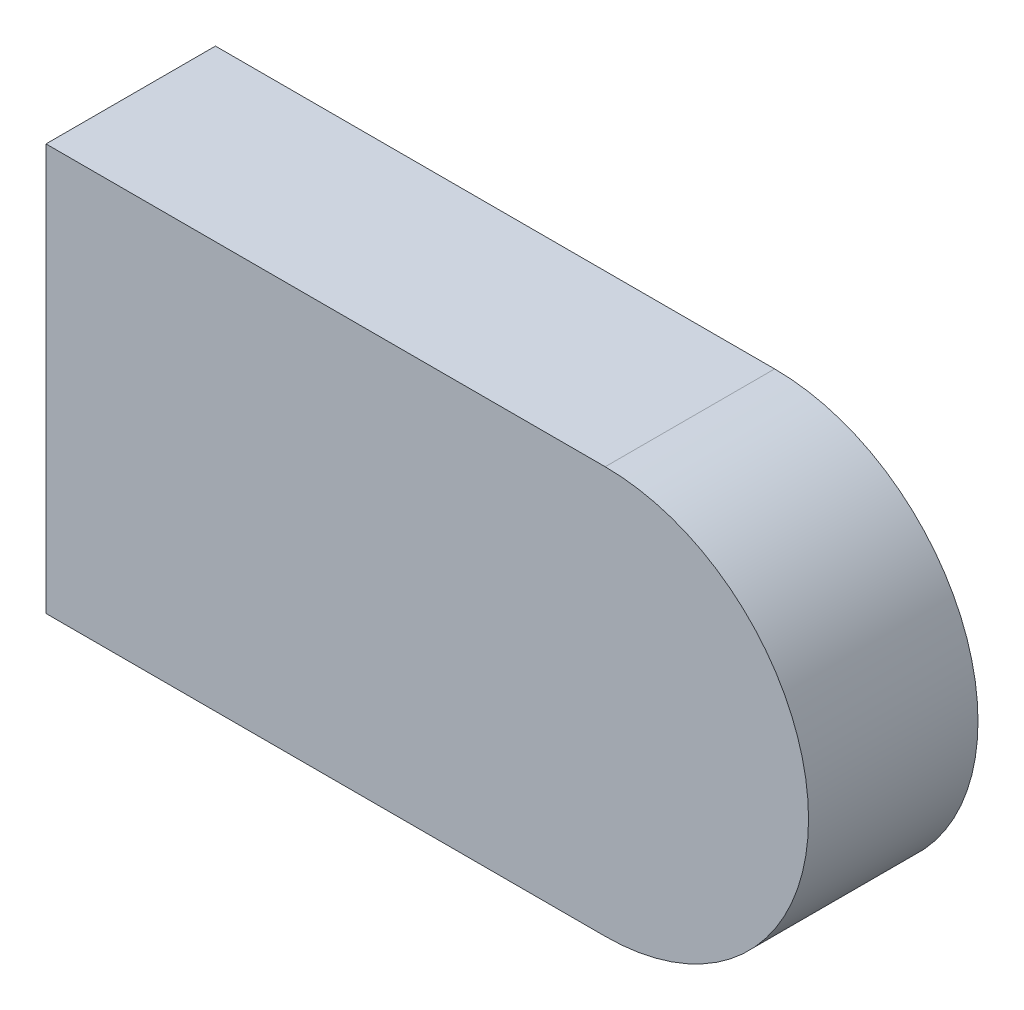
ISO-10303-21;
HEADER;
FILE_DESCRIPTION(('STEP AP214'),'2;1');
FILE_NAME('part.step','',(''),(''),'','','');
FILE_SCHEMA(('AUTOMOTIVE_DESIGN { 1 0 10303 214 1 1 1 1 }'));
ENDSEC;
DATA;
#1=APPLICATION_CONTEXT('core data for automotive mechanical design processes');
#2=APPLICATION_PROTOCOL_DEFINITION('international standard','automotive_design',2000,#1);
#3=PRODUCT_CONTEXT('',#1,'mechanical');
#4=PRODUCT('Part','Part','',(#3));
#5=PRODUCT_RELATED_PRODUCT_CATEGORY('part','',(#4));
#6=PRODUCT_DEFINITION_FORMATION('','',#4);
#7=PRODUCT_DEFINITION_CONTEXT('part definition',#1,'design');
#8=PRODUCT_DEFINITION('design','',#6,#7);
#9=PRODUCT_DEFINITION_SHAPE('','',#8);
#10=(LENGTH_UNIT() NAMED_UNIT(*) SI_UNIT(.MILLI.,.METRE.));
#11=(NAMED_UNIT(*) PLANE_ANGLE_UNIT() SI_UNIT($,.RADIAN.));
#12=(NAMED_UNIT(*) SI_UNIT($,.STERADIAN.) SOLID_ANGLE_UNIT());
#13=UNCERTAINTY_MEASURE_WITH_UNIT(LENGTH_MEASURE(1.E-05),#10,'distance_accuracy_value','');
#14=(GEOMETRIC_REPRESENTATION_CONTEXT(3) GLOBAL_UNCERTAINTY_ASSIGNED_CONTEXT((#13)) GLOBAL_UNIT_ASSIGNED_CONTEXT((#10,
#11,#12)) REPRESENTATION_CONTEXT('',''));
#15=CARTESIAN_POINT('',(0.,0.,0.));
#16=DIRECTION('',(0.,0.,1.));
#17=DIRECTION('',(1.,0.,0.));
#18=AXIS2_PLACEMENT_3D('',#15,#16,#17);
#19=CARTESIAN_POINT('',(-4.05,-1.87,0.));
#20=DIRECTION('',(0.,1.,0.));
#21=DIRECTION('',(1.,0.,0.));
#22=AXIS2_PLACEMENT_3D('',#19,#20,#21);
#23=PLANE('',#22);
#24=DIRECTION('',(1.,0.,0.));
#25=VECTOR('',#24,1.);
#26=CARTESIAN_POINT('',(-4.05,-1.87,0.));
#27=LINE('',#26,#25);
#28=CARTESIAN_POINT('',(-4.05,-1.87,0.));
#29=VERTEX_POINT('',#28);
#30=CARTESIAN_POINT('',(-3.72,-1.87,0.));
#31=VERTEX_POINT('',#30);
#32=EDGE_CURVE('E11',#29,#31,#27,.T.);
#33=ORIENTED_EDGE('',*,*,#32,.T.);
#34=DIRECTION('',(0.,0.,1.));
#35=VECTOR('',#34,1.);
#36=CARTESIAN_POINT('',(-3.72,-1.87,0.));
#37=LINE('',#36,#35);
#38=CARTESIAN_POINT('',(-3.72,-1.87,0.1));
#39=VERTEX_POINT('',#38);
#40=EDGE_CURVE('E24',#31,#39,#37,.T.);
#41=ORIENTED_EDGE('',*,*,#40,.T.);
#42=DIRECTION('',(1.,0.,0.));
#43=VECTOR('',#42,1.);
#44=CARTESIAN_POINT('',(-4.05,-1.87,0.1));
#45=LINE('',#44,#43);
#46=CARTESIAN_POINT('',(-4.05,-1.87,0.1));
#47=VERTEX_POINT('',#46);
#48=EDGE_CURVE('E88',#47,#39,#45,.T.);
#49=ORIENTED_EDGE('',*,*,#48,.F.);
#50=DIRECTION('',(0.,0.,1.));
#51=VECTOR('',#50,1.);
#52=CARTESIAN_POINT('',(-4.05,-1.87,0.));
#53=LINE('',#52,#51);
#54=EDGE_CURVE('E36',#29,#47,#53,.T.);
#55=ORIENTED_EDGE('',*,*,#54,.F.);
#56=EDGE_LOOP('',(#33,#41,#49,#55));
#57=FACE_BOUND('',#56,.T.);
#58=ADVANCED_FACE('F17',(#57),#23,.F.);
#59=CARTESIAN_POINT('',(-3.72,-1.75,0.));
#60=DIRECTION('',(0.,0.,-1.));
#61=DIRECTION('',(1.,0.,0.));
#62=AXIS2_PLACEMENT_3D('',#59,#60,#61);
#63=CYLINDRICAL_SURFACE('',#62,0.12);
#64=CARTESIAN_POINT('',(-3.72,-1.75,0.));
#65=DIRECTION('',(0.,0.,1.));
#66=DIRECTION('',(1.,0.,0.));
#67=AXIS2_PLACEMENT_3D('',#64,#65,#66);
#68=CIRCLE('',#67,0.12);
#69=CARTESIAN_POINT('',(-3.72,-1.63,0.));
#70=VERTEX_POINT('',#69);
#71=EDGE_CURVE('E85',#31,#70,#68,.T.);
#72=ORIENTED_EDGE('',*,*,#71,.T.);
#73=DIRECTION('',(0.,0.,1.));
#74=VECTOR('',#73,1.);
#75=CARTESIAN_POINT('',(-3.72,-1.63,0.));
#76=LINE('',#75,#74);
#77=CARTESIAN_POINT('',(-3.72,-1.63,0.1));
#78=VERTEX_POINT('',#77);
#79=EDGE_CURVE('E73',#70,#78,#76,.T.);
#80=ORIENTED_EDGE('',*,*,#79,.T.);
#81=CARTESIAN_POINT('',(-3.72,-1.75,0.1));
#82=DIRECTION('',(0.,0.,1.));
#83=DIRECTION('',(1.,0.,0.));
#84=AXIS2_PLACEMENT_3D('',#81,#82,#83);
#85=CIRCLE('',#84,0.12);
#86=EDGE_CURVE('E66',#39,#78,#85,.T.);
#87=ORIENTED_EDGE('',*,*,#86,.F.);
#88=ORIENTED_EDGE('',*,*,#40,.F.);
#89=EDGE_LOOP('',(#72,#80,#87,#88));
#90=FACE_BOUND('',#89,.T.);
#91=ADVANCED_FACE('F89',(#90),#63,.T.);
#92=CARTESIAN_POINT('',(-4.05,-1.63,0.));
#93=DIRECTION('',(0.,1.,0.));
#94=DIRECTION('',(1.,0.,0.));
#95=AXIS2_PLACEMENT_3D('',#92,#93,#94);
#96=PLANE('',#95);
#97=DIRECTION('',(0.,0.,1.));
#98=VECTOR('',#97,1.);
#99=CARTESIAN_POINT('',(-4.05,-1.63,0.));
#100=LINE('',#99,#98);
#101=CARTESIAN_POINT('',(-4.05,-1.63,0.));
#102=VERTEX_POINT('',#101);
#103=CARTESIAN_POINT('',(-4.05,-1.63,0.1));
#104=VERTEX_POINT('',#103);
#105=EDGE_CURVE('E56',#102,#104,#100,.T.);
#106=ORIENTED_EDGE('',*,*,#105,.T.);
#107=DIRECTION('',(1.,0.,0.));
#108=VECTOR('',#107,1.);
#109=CARTESIAN_POINT('',(-4.05,-1.63,0.1));
#110=LINE('',#109,#108);
#111=EDGE_CURVE('E67',#104,#78,#110,.T.);
#112=ORIENTED_EDGE('',*,*,#111,.T.);
#113=ORIENTED_EDGE('',*,*,#79,.F.);
#114=DIRECTION('',(1.,0.,0.));
#115=VECTOR('',#114,1.);
#116=CARTESIAN_POINT('',(-4.05,-1.63,0.));
#117=LINE('',#116,#115);
#118=EDGE_CURVE('E71',#102,#70,#117,.T.);
#119=ORIENTED_EDGE('',*,*,#118,.F.);
#120=EDGE_LOOP('',(#106,#112,#113,#119));
#121=FACE_BOUND('',#120,.T.);
#122=ADVANCED_FACE('F72',(#121),#96,.T.);
#123=CARTESIAN_POINT('',(-4.05,-1.87,0.));
#124=DIRECTION('',(-1.,0.,0.));
#125=DIRECTION('',(0.,1.,0.));
#126=AXIS2_PLACEMENT_3D('',#123,#124,#125);
#127=PLANE('',#126);
#128=ORIENTED_EDGE('',*,*,#54,.T.);
#129=DIRECTION('',(0.,1.,0.));
#130=VECTOR('',#129,1.);
#131=CARTESIAN_POINT('',(-4.05,-1.87,0.1));
#132=LINE('',#131,#130);
#133=EDGE_CURVE('E62',#47,#104,#132,.T.);
#134=ORIENTED_EDGE('',*,*,#133,.T.);
#135=ORIENTED_EDGE('',*,*,#105,.F.);
#136=DIRECTION('',(0.,1.,0.));
#137=VECTOR('',#136,1.);
#138=CARTESIAN_POINT('',(-4.05,-1.87,0.));
#139=LINE('',#138,#137);
#140=EDGE_CURVE('E60',#29,#102,#139,.T.);
#141=ORIENTED_EDGE('',*,*,#140,.F.);
#142=EDGE_LOOP('',(#128,#134,#135,#141));
#143=FACE_BOUND('',#142,.T.);
#144=ADVANCED_FACE('F58',(#143),#127,.T.);
#145=CARTESIAN_POINT('',(-3.849490847913,-1.75,0.));
#146=DIRECTION('',(0.,0.,1.));
#147=DIRECTION('',(1.,0.,0.));
#148=AXIS2_PLACEMENT_3D('',#145,#146,#147);
#149=PLANE('',#148);
#150=ORIENTED_EDGE('',*,*,#140,.T.);
#151=ORIENTED_EDGE('',*,*,#118,.T.);
#152=ORIENTED_EDGE('',*,*,#71,.F.);
#153=ORIENTED_EDGE('',*,*,#32,.F.);
#154=EDGE_LOOP('',(#150,#151,#152,#153));
#155=FACE_BOUND('',#154,.T.);
#156=ADVANCED_FACE('F77',(#155),#149,.F.);
#157=CARTESIAN_POINT('',(-3.849490847913,-1.75,0.1));
#158=DIRECTION('',(0.,0.,1.));
#159=DIRECTION('',(1.,0.,0.));
#160=AXIS2_PLACEMENT_3D('',#157,#158,#159);
#161=PLANE('',#160);
#162=ORIENTED_EDGE('',*,*,#48,.T.);
#163=ORIENTED_EDGE('',*,*,#86,.T.);
#164=ORIENTED_EDGE('',*,*,#111,.F.);
#165=ORIENTED_EDGE('',*,*,#133,.F.);
#166=EDGE_LOOP('',(#162,#163,#164,#165));
#167=FACE_BOUND('',#166,.T.);
#168=ADVANCED_FACE('F91',(#167),#161,.T.);
#169=CLOSED_SHELL('',(#58,#91,#122,#144,#156,#168));
#170=MANIFOLD_SOLID_BREP('B1',#169);
#171=ADVANCED_BREP_SHAPE_REPRESENTATION('',(#18,#170),#14);
#172=SHAPE_DEFINITION_REPRESENTATION(#9,#171);
ENDSEC;
END-ISO-10303-21;
